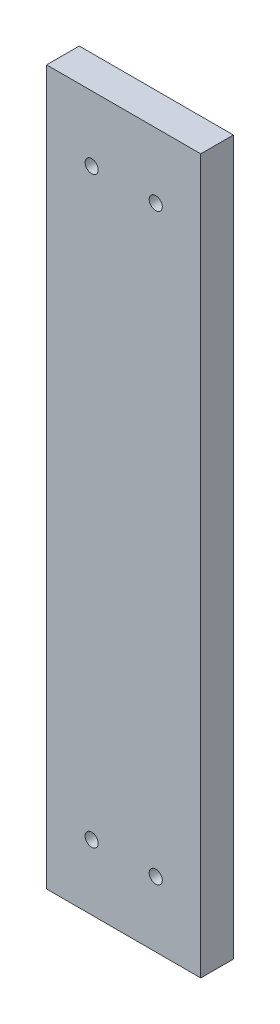
ISO-10303-21;
HEADER;
FILE_DESCRIPTION(('STEP AP214'),'2;1');
FILE_NAME('part.step','',(''),(''),'','','');
FILE_SCHEMA(('AUTOMOTIVE_DESIGN { 1 0 10303 214 1 1 1 1 }'));
ENDSEC;
DATA;
#1=APPLICATION_CONTEXT('core data for automotive mechanical design processes');
#2=APPLICATION_PROTOCOL_DEFINITION('international standard','automotive_design',2000,#1);
#3=PRODUCT_CONTEXT('',#1,'mechanical');
#4=PRODUCT('Part','Part','',(#3));
#5=PRODUCT_RELATED_PRODUCT_CATEGORY('part','',(#4));
#6=PRODUCT_DEFINITION_FORMATION('','',#4);
#7=PRODUCT_DEFINITION_CONTEXT('part definition',#1,'design');
#8=PRODUCT_DEFINITION('design','',#6,#7);
#9=PRODUCT_DEFINITION_SHAPE('','',#8);
#10=(LENGTH_UNIT() NAMED_UNIT(*) SI_UNIT(.MILLI.,.METRE.));
#11=(NAMED_UNIT(*) PLANE_ANGLE_UNIT() SI_UNIT($,.RADIAN.));
#12=(NAMED_UNIT(*) SI_UNIT($,.STERADIAN.) SOLID_ANGLE_UNIT());
#13=UNCERTAINTY_MEASURE_WITH_UNIT(LENGTH_MEASURE(1.E-05),#10,'distance_accuracy_value','');
#14=(GEOMETRIC_REPRESENTATION_CONTEXT(3) GLOBAL_UNCERTAINTY_ASSIGNED_CONTEXT((#13)) GLOBAL_UNIT_ASSIGNED_CONTEXT((#10,
#11,#12)) REPRESENTATION_CONTEXT('',''));
#15=CARTESIAN_POINT('',(0.,0.,0.));
#16=DIRECTION('',(0.,0.,1.));
#17=DIRECTION('',(1.,0.,0.));
#18=AXIS2_PLACEMENT_3D('',#15,#16,#17);
#19=CARTESIAN_POINT('',(0.,277.876,0.));
#20=DIRECTION('',(1.,0.,0.));
#21=DIRECTION('',(0.,0.,-1.));
#22=AXIS2_PLACEMENT_3D('',#19,#20,#21);
#23=PLANE('',#22);
#24=DIRECTION('',(0.,0.,1.));
#25=VECTOR('',#24,1.);
#26=CARTESIAN_POINT('',(0.,0.,0.));
#27=LINE('',#26,#25);
#28=CARTESIAN_POINT('',(0.,0.,-12.7));
#29=VERTEX_POINT('',#28);
#30=CARTESIAN_POINT('',(0.,0.,0.));
#31=VERTEX_POINT('',#30);
#32=EDGE_CURVE('E101',#29,#31,#27,.T.);
#33=ORIENTED_EDGE('',*,*,#32,.T.);
#34=DIRECTION('',(0.,-1.,0.));
#35=VECTOR('',#34,1.);
#36=CARTESIAN_POINT('',(0.,277.876,0.));
#37=LINE('',#36,#35);
#38=CARTESIAN_POINT('',(0.,277.876,0.));
#39=VERTEX_POINT('',#38);
#40=EDGE_CURVE('E11',#39,#31,#37,.T.);
#41=ORIENTED_EDGE('',*,*,#40,.F.);
#42=DIRECTION('',(0.,0.,1.));
#43=VECTOR('',#42,1.);
#44=CARTESIAN_POINT('',(0.,277.876,0.));
#45=LINE('',#44,#43);
#46=CARTESIAN_POINT('',(0.,277.876,-12.7));
#47=VERTEX_POINT('',#46);
#48=EDGE_CURVE('E89',#47,#39,#45,.T.);
#49=ORIENTED_EDGE('',*,*,#48,.F.);
#50=DIRECTION('',(0.,-1.,0.));
#51=VECTOR('',#50,1.);
#52=CARTESIAN_POINT('',(0.,277.876,-12.7));
#53=LINE('',#52,#51);
#54=EDGE_CURVE('E97',#47,#29,#53,.T.);
#55=ORIENTED_EDGE('',*,*,#54,.T.);
#56=EDGE_LOOP('',(#33,#41,#49,#55));
#57=FACE_BOUND('',#56,.T.);
#58=ADVANCED_FACE('F38',(#57),#23,.F.);
#59=CARTESIAN_POINT('',(0.,277.876,0.));
#60=DIRECTION('',(0.,0.,-1.));
#61=DIRECTION('',(-1.,0.,0.));
#62=AXIS2_PLACEMENT_3D('',#59,#60,#61);
#63=PLANE('',#62);
#64=CARTESIAN_POINT('',(17.526,252.476,0.));
#65=DIRECTION('',(0.,0.,1.));
#66=DIRECTION('',(1.,0.,0.));
#67=AXIS2_PLACEMENT_3D('',#64,#65,#66);
#68=CIRCLE('',#67,2.55269999999999);
#69=CARTESIAN_POINT('',(20.0787,252.476,0.));
#70=VERTEX_POINT('',#69);
#71=EDGE_CURVE('E135',#70,#70,#68,.T.);
#72=ORIENTED_EDGE('',*,*,#71,.F.);
#73=EDGE_LOOP('',(#72));
#74=FACE_BOUND('',#73,.T.);
#75=CARTESIAN_POINT('',(42.474,252.476,0.));
#76=DIRECTION('',(0.,0.,1.));
#77=DIRECTION('',(1.,0.,0.));
#78=AXIS2_PLACEMENT_3D('',#75,#76,#77);
#79=CIRCLE('',#78,2.55269999999999);
#80=CARTESIAN_POINT('',(45.0267,252.476,0.));
#81=VERTEX_POINT('',#80);
#82=EDGE_CURVE('E129',#81,#81,#79,.T.);
#83=ORIENTED_EDGE('',*,*,#82,.F.);
#84=EDGE_LOOP('',(#83));
#85=FACE_BOUND('',#84,.T.);
#86=CARTESIAN_POINT('',(17.526,25.4,0.));
#87=DIRECTION('',(0.,0.,1.));
#88=DIRECTION('',(1.,0.,0.));
#89=AXIS2_PLACEMENT_3D('',#86,#87,#88);
#90=CIRCLE('',#89,2.55269999999999);
#91=CARTESIAN_POINT('',(20.0787,25.4,0.));
#92=VERTEX_POINT('',#91);
#93=EDGE_CURVE('E123',#92,#92,#90,.T.);
#94=ORIENTED_EDGE('',*,*,#93,.F.);
#95=EDGE_LOOP('',(#94));
#96=FACE_BOUND('',#95,.T.);
#97=CARTESIAN_POINT('',(42.474,25.4,0.));
#98=DIRECTION('',(0.,0.,1.));
#99=DIRECTION('',(1.,0.,0.));
#100=AXIS2_PLACEMENT_3D('',#97,#98,#99);
#101=CIRCLE('',#100,2.55269999999999);
#102=CARTESIAN_POINT('',(45.0267,25.4,0.));
#103=VERTEX_POINT('',#102);
#104=EDGE_CURVE('E117',#103,#103,#101,.T.);
#105=ORIENTED_EDGE('',*,*,#104,.F.);
#106=EDGE_LOOP('',(#105));
#107=FACE_BOUND('',#106,.T.);
#108=DIRECTION('',(1.,0.,0.));
#109=VECTOR('',#108,1.);
#110=CARTESIAN_POINT('',(0.,0.,0.));
#111=LINE('',#110,#109);
#112=CARTESIAN_POINT('',(60.,0.,0.));
#113=VERTEX_POINT('',#112);
#114=EDGE_CURVE('E93',#31,#113,#111,.T.);
#115=ORIENTED_EDGE('',*,*,#114,.T.);
#116=DIRECTION('',(0.,-1.,0.));
#117=VECTOR('',#116,1.);
#118=CARTESIAN_POINT('',(60.,277.876,0.));
#119=LINE('',#118,#117);
#120=CARTESIAN_POINT('',(60.,277.876,0.));
#121=VERTEX_POINT('',#120);
#122=EDGE_CURVE('E46',#121,#113,#119,.T.);
#123=ORIENTED_EDGE('',*,*,#122,.F.);
#124=DIRECTION('',(1.,0.,0.));
#125=VECTOR('',#124,1.);
#126=CARTESIAN_POINT('',(0.,277.876,0.));
#127=LINE('',#126,#125);
#128=EDGE_CURVE('E84',#39,#121,#127,.T.);
#129=ORIENTED_EDGE('',*,*,#128,.F.);
#130=ORIENTED_EDGE('',*,*,#40,.T.);
#131=EDGE_LOOP('',(#115,#123,#129,#130));
#132=FACE_BOUND('',#131,.T.);
#133=ADVANCED_FACE('F92',(#74,#85,#96,#107,#132),#63,.F.);
#134=CARTESIAN_POINT('',(60.,277.876,0.));
#135=DIRECTION('',(-1.,0.,0.));
#136=DIRECTION('',(0.,0.,1.));
#137=AXIS2_PLACEMENT_3D('',#134,#135,#136);
#138=PLANE('',#137);
#139=DIRECTION('',(0.,0.,-1.));
#140=VECTOR('',#139,1.);
#141=CARTESIAN_POINT('',(60.,0.,0.));
#142=LINE('',#141,#140);
#143=CARTESIAN_POINT('',(60.,0.,-12.7));
#144=VERTEX_POINT('',#143);
#145=EDGE_CURVE('E71',#113,#144,#142,.T.);
#146=ORIENTED_EDGE('',*,*,#145,.T.);
#147=DIRECTION('',(0.,-1.,0.));
#148=VECTOR('',#147,1.);
#149=CARTESIAN_POINT('',(60.,277.876,-12.7));
#150=LINE('',#149,#148);
#151=CARTESIAN_POINT('',(60.,277.876,-12.7));
#152=VERTEX_POINT('',#151);
#153=EDGE_CURVE('E94',#152,#144,#150,.T.);
#154=ORIENTED_EDGE('',*,*,#153,.F.);
#155=DIRECTION('',(0.,0.,-1.));
#156=VECTOR('',#155,1.);
#157=CARTESIAN_POINT('',(60.,277.876,0.));
#158=LINE('',#157,#156);
#159=EDGE_CURVE('E87',#121,#152,#158,.T.);
#160=ORIENTED_EDGE('',*,*,#159,.F.);
#161=ORIENTED_EDGE('',*,*,#122,.T.);
#162=EDGE_LOOP('',(#146,#154,#160,#161));
#163=FACE_BOUND('',#162,.T.);
#164=ADVANCED_FACE('F95',(#163),#138,.F.);
#165=CARTESIAN_POINT('',(0.,277.876,-12.7));
#166=DIRECTION('',(0.,0.,1.));
#167=DIRECTION('',(1.,0.,0.));
#168=AXIS2_PLACEMENT_3D('',#165,#166,#167);
#169=PLANE('',#168);
#170=CARTESIAN_POINT('',(17.526,252.476,-12.7));
#171=DIRECTION('',(0.,0.,1.));
#172=DIRECTION('',(1.,0.,0.));
#173=AXIS2_PLACEMENT_3D('',#170,#171,#172);
#174=CIRCLE('',#173,2.55269999999999);
#175=CARTESIAN_POINT('',(20.0787,252.476,-12.7));
#176=VERTEX_POINT('',#175);
#177=EDGE_CURVE('E132',#176,#176,#174,.T.);
#178=ORIENTED_EDGE('',*,*,#177,.T.);
#179=EDGE_LOOP('',(#178));
#180=FACE_BOUND('',#179,.T.);
#181=CARTESIAN_POINT('',(42.474,252.476,-12.7));
#182=DIRECTION('',(0.,0.,1.));
#183=DIRECTION('',(1.,0.,0.));
#184=AXIS2_PLACEMENT_3D('',#181,#182,#183);
#185=CIRCLE('',#184,2.55269999999999);
#186=CARTESIAN_POINT('',(45.0267,252.476,-12.7));
#187=VERTEX_POINT('',#186);
#188=EDGE_CURVE('E126',#187,#187,#185,.T.);
#189=ORIENTED_EDGE('',*,*,#188,.T.);
#190=EDGE_LOOP('',(#189));
#191=FACE_BOUND('',#190,.T.);
#192=CARTESIAN_POINT('',(17.526,25.4,-12.7));
#193=DIRECTION('',(0.,0.,1.));
#194=DIRECTION('',(1.,0.,0.));
#195=AXIS2_PLACEMENT_3D('',#192,#193,#194);
#196=CIRCLE('',#195,2.55269999999999);
#197=CARTESIAN_POINT('',(20.0787,25.4,-12.7));
#198=VERTEX_POINT('',#197);
#199=EDGE_CURVE('E120',#198,#198,#196,.T.);
#200=ORIENTED_EDGE('',*,*,#199,.T.);
#201=EDGE_LOOP('',(#200));
#202=FACE_BOUND('',#201,.T.);
#203=CARTESIAN_POINT('',(42.474,25.4,-12.7));
#204=DIRECTION('',(0.,0.,1.));
#205=DIRECTION('',(1.,0.,0.));
#206=AXIS2_PLACEMENT_3D('',#203,#204,#205);
#207=CIRCLE('',#206,2.55269999999999);
#208=CARTESIAN_POINT('',(45.0267,25.4,-12.7));
#209=VERTEX_POINT('',#208);
#210=EDGE_CURVE('E104',#209,#209,#207,.T.);
#211=ORIENTED_EDGE('',*,*,#210,.T.);
#212=EDGE_LOOP('',(#211));
#213=FACE_BOUND('',#212,.T.);
#214=DIRECTION('',(-1.,0.,0.));
#215=VECTOR('',#214,1.);
#216=CARTESIAN_POINT('',(0.,0.,-12.7));
#217=LINE('',#216,#215);
#218=EDGE_CURVE('E77',#144,#29,#217,.T.);
#219=ORIENTED_EDGE('',*,*,#218,.T.);
#220=ORIENTED_EDGE('',*,*,#54,.F.);
#221=DIRECTION('',(-1.,0.,0.));
#222=VECTOR('',#221,1.);
#223=CARTESIAN_POINT('',(0.,277.876,-12.7));
#224=LINE('',#223,#222);
#225=EDGE_CURVE('E54',#152,#47,#224,.T.);
#226=ORIENTED_EDGE('',*,*,#225,.F.);
#227=ORIENTED_EDGE('',*,*,#153,.T.);
#228=EDGE_LOOP('',(#219,#220,#226,#227));
#229=FACE_BOUND('',#228,.T.);
#230=ADVANCED_FACE('F109',(#180,#191,#202,#213,#229),#169,.F.);
#231=CARTESIAN_POINT('',(0.,277.876,0.));
#232=DIRECTION('',(0.,-1.,0.));
#233=DIRECTION('',(0.,0.,-1.));
#234=AXIS2_PLACEMENT_3D('',#231,#232,#233);
#235=PLANE('',#234);
#236=ORIENTED_EDGE('',*,*,#48,.T.);
#237=ORIENTED_EDGE('',*,*,#128,.T.);
#238=ORIENTED_EDGE('',*,*,#159,.T.);
#239=ORIENTED_EDGE('',*,*,#225,.T.);
#240=EDGE_LOOP('',(#236,#237,#238,#239));
#241=FACE_BOUND('',#240,.T.);
#242=ADVANCED_FACE('F85',(#241),#235,.F.);
#243=CARTESIAN_POINT('',(0.,0.,0.));
#244=DIRECTION('',(0.,-1.,0.));
#245=DIRECTION('',(0.,0.,-1.));
#246=AXIS2_PLACEMENT_3D('',#243,#244,#245);
#247=PLANE('',#246);
#248=ORIENTED_EDGE('',*,*,#32,.F.);
#249=ORIENTED_EDGE('',*,*,#218,.F.);
#250=ORIENTED_EDGE('',*,*,#145,.F.);
#251=ORIENTED_EDGE('',*,*,#114,.F.);
#252=EDGE_LOOP('',(#248,#249,#250,#251));
#253=FACE_BOUND('',#252,.T.);
#254=ADVANCED_FACE('F112',(#253),#247,.T.);
#255=CARTESIAN_POINT('',(42.474,25.4,0.));
#256=DIRECTION('',(0.,0.,1.));
#257=DIRECTION('',(1.,0.,0.));
#258=AXIS2_PLACEMENT_3D('',#255,#256,#257);
#259=CYLINDRICAL_SURFACE('',#258,2.55269999999999);
#260=ORIENTED_EDGE('',*,*,#210,.F.);
#261=EDGE_LOOP('',(#260));
#262=FACE_BOUND('',#261,.T.);
#263=ORIENTED_EDGE('',*,*,#104,.T.);
#264=EDGE_LOOP('',(#263));
#265=FACE_BOUND('',#264,.T.);
#266=ADVANCED_FACE('F149',(#262,#265),#259,.F.);
#267=CARTESIAN_POINT('',(17.526,25.4,0.));
#268=DIRECTION('',(0.,0.,1.));
#269=DIRECTION('',(1.,0.,0.));
#270=AXIS2_PLACEMENT_3D('',#267,#268,#269);
#271=CYLINDRICAL_SURFACE('',#270,2.55269999999999);
#272=ORIENTED_EDGE('',*,*,#199,.F.);
#273=EDGE_LOOP('',(#272));
#274=FACE_BOUND('',#273,.T.);
#275=ORIENTED_EDGE('',*,*,#93,.T.);
#276=EDGE_LOOP('',(#275));
#277=FACE_BOUND('',#276,.T.);
#278=ADVANCED_FACE('F151',(#274,#277),#271,.F.);
#279=CARTESIAN_POINT('',(42.474,252.476,0.));
#280=DIRECTION('',(0.,0.,1.));
#281=DIRECTION('',(1.,0.,0.));
#282=AXIS2_PLACEMENT_3D('',#279,#280,#281);
#283=CYLINDRICAL_SURFACE('',#282,2.55269999999999);
#284=ORIENTED_EDGE('',*,*,#188,.F.);
#285=EDGE_LOOP('',(#284));
#286=FACE_BOUND('',#285,.T.);
#287=ORIENTED_EDGE('',*,*,#82,.T.);
#288=EDGE_LOOP('',(#287));
#289=FACE_BOUND('',#288,.T.);
#290=ADVANCED_FACE('F158',(#286,#289),#283,.F.);
#291=CARTESIAN_POINT('',(17.526,252.476,0.));
#292=DIRECTION('',(0.,0.,1.));
#293=DIRECTION('',(1.,0.,0.));
#294=AXIS2_PLACEMENT_3D('',#291,#292,#293);
#295=CYLINDRICAL_SURFACE('',#294,2.55269999999999);
#296=ORIENTED_EDGE('',*,*,#177,.F.);
#297=EDGE_LOOP('',(#296));
#298=FACE_BOUND('',#297,.T.);
#299=ORIENTED_EDGE('',*,*,#71,.T.);
#300=EDGE_LOOP('',(#299));
#301=FACE_BOUND('',#300,.T.);
#302=ADVANCED_FACE('F139',(#298,#301),#295,.F.);
#303=CLOSED_SHELL('',(#58,#133,#164,#230,#242,#254,#266,#278,#290,#302));
#304=MANIFOLD_SOLID_BREP('B2',#303);
#305=ADVANCED_BREP_SHAPE_REPRESENTATION('',(#18,#304),#14);
#306=SHAPE_DEFINITION_REPRESENTATION(#9,#305);
ENDSEC;
END-ISO-10303-21;
